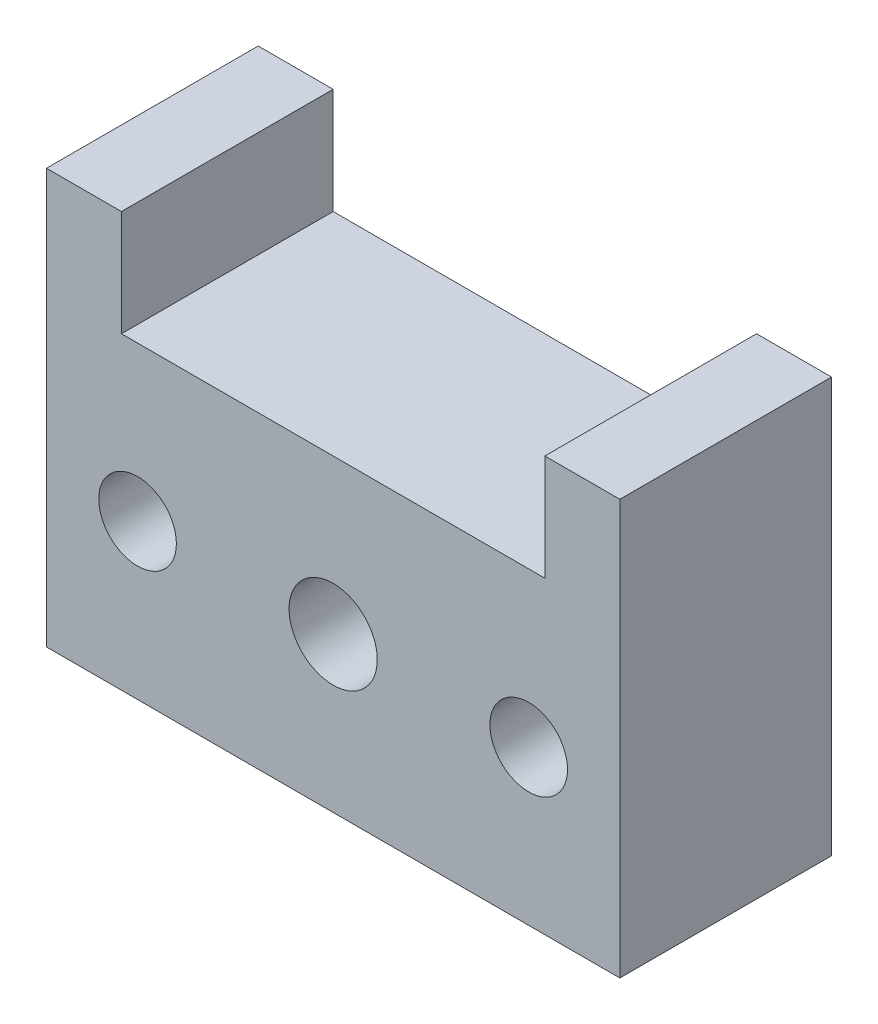
ISO-10303-21;
HEADER;
FILE_DESCRIPTION(('STEP AP214'),'2;1');
FILE_NAME('part.step','',(''),(''),'','','');
FILE_SCHEMA(('AUTOMOTIVE_DESIGN { 1 0 10303 214 1 1 1 1 }'));
ENDSEC;
DATA;
#1=APPLICATION_CONTEXT('core data for automotive mechanical design processes');
#2=APPLICATION_PROTOCOL_DEFINITION('international standard','automotive_design',2000,#1);
#3=PRODUCT_CONTEXT('',#1,'mechanical');
#4=PRODUCT('Part','Part','',(#3));
#5=PRODUCT_RELATED_PRODUCT_CATEGORY('part','',(#4));
#6=PRODUCT_DEFINITION_FORMATION('','',#4);
#7=PRODUCT_DEFINITION_CONTEXT('part definition',#1,'design');
#8=PRODUCT_DEFINITION('design','',#6,#7);
#9=PRODUCT_DEFINITION_SHAPE('','',#8);
#10=(LENGTH_UNIT() NAMED_UNIT(*) SI_UNIT(.MILLI.,.METRE.));
#11=(NAMED_UNIT(*) PLANE_ANGLE_UNIT() SI_UNIT($,.RADIAN.));
#12=(NAMED_UNIT(*) SI_UNIT($,.STERADIAN.) SOLID_ANGLE_UNIT());
#13=UNCERTAINTY_MEASURE_WITH_UNIT(LENGTH_MEASURE(1.E-05),#10,'distance_accuracy_value','');
#14=(GEOMETRIC_REPRESENTATION_CONTEXT(3) GLOBAL_UNCERTAINTY_ASSIGNED_CONTEXT((#13)) GLOBAL_UNIT_ASSIGNED_CONTEXT((#10,
#11,#12)) REPRESENTATION_CONTEXT('',''));
#15=CARTESIAN_POINT('',(0.,0.,0.));
#16=DIRECTION('',(0.,0.,1.));
#17=DIRECTION('',(1.,0.,0.));
#18=AXIS2_PLACEMENT_3D('',#15,#16,#17);
#19=CARTESIAN_POINT('',(22.1712802086963,0.,24.));
#20=DIRECTION('',(0.,0.,-1.));
#21=DIRECTION('',(-1.,0.,0.));
#22=AXIS2_PLACEMENT_3D('',#19,#20,#21);
#23=CYLINDRICAL_SURFACE('',#22,4.4);
#24=CARTESIAN_POINT('',(22.1712802086963,0.,24.));
#25=DIRECTION('',(0.,0.,1.));
#26=DIRECTION('',(1.,0.,0.));
#27=AXIS2_PLACEMENT_3D('',#24,#25,#26);
#28=CIRCLE('',#27,4.4);
#29=CARTESIAN_POINT('',(26.5712802086963,0.,24.));
#30=VERTEX_POINT('',#29);
#31=EDGE_CURVE('E145',#30,#30,#28,.F.);
#32=ORIENTED_EDGE('',*,*,#31,.F.);
#33=EDGE_LOOP('',(#32));
#34=FACE_BOUND('',#33,.T.);
#35=CARTESIAN_POINT('',(22.1712802086963,0.,0.));
#36=DIRECTION('',(0.,0.,1.));
#37=DIRECTION('',(1.,0.,0.));
#38=AXIS2_PLACEMENT_3D('',#35,#36,#37);
#39=CIRCLE('',#38,4.4);
#40=CARTESIAN_POINT('',(26.5712802086963,0.,0.));
#41=VERTEX_POINT('',#40);
#42=EDGE_CURVE('E146',#41,#41,#39,.F.);
#43=ORIENTED_EDGE('',*,*,#42,.T.);
#44=EDGE_LOOP('',(#43));
#45=FACE_BOUND('',#44,.T.);
#46=ADVANCED_FACE('F41',(#34,#45),#23,.F.);
#47=CARTESIAN_POINT('',(-22.1712802086963,0.,24.));
#48=DIRECTION('',(0.,0.,-1.));
#49=DIRECTION('',(-1.,0.,0.));
#50=AXIS2_PLACEMENT_3D('',#47,#48,#49);
#51=CYLINDRICAL_SURFACE('',#50,4.4);
#52=CARTESIAN_POINT('',(-22.1712802086963,0.,24.));
#53=DIRECTION('',(0.,0.,1.));
#54=DIRECTION('',(1.,0.,0.));
#55=AXIS2_PLACEMENT_3D('',#52,#53,#54);
#56=CIRCLE('',#55,4.4);
#57=CARTESIAN_POINT('',(-17.7712802086963,0.,24.));
#58=VERTEX_POINT('',#57);
#59=EDGE_CURVE('E164',#58,#58,#56,.T.);
#60=ORIENTED_EDGE('',*,*,#59,.T.);
#61=EDGE_LOOP('',(#60));
#62=FACE_BOUND('',#61,.T.);
#63=CARTESIAN_POINT('',(-22.1712802086963,0.,0.));
#64=DIRECTION('',(0.,0.,1.));
#65=DIRECTION('',(1.,0.,0.));
#66=AXIS2_PLACEMENT_3D('',#63,#64,#65);
#67=CIRCLE('',#66,4.4);
#68=CARTESIAN_POINT('',(-17.7712802086963,0.,0.));
#69=VERTEX_POINT('',#68);
#70=EDGE_CURVE('E150',#69,#69,#67,.T.);
#71=ORIENTED_EDGE('',*,*,#70,.F.);
#72=EDGE_LOOP('',(#71));
#73=FACE_BOUND('',#72,.T.);
#74=ADVANCED_FACE('F217',(#62,#73),#51,.F.);
#75=CARTESIAN_POINT('',(0.,0.,24.));
#76=DIRECTION('',(0.,0.,-1.));
#77=DIRECTION('',(-1.,0.,0.));
#78=AXIS2_PLACEMENT_3D('',#75,#76,#77);
#79=CYLINDRICAL_SURFACE('',#78,5.);
#80=CARTESIAN_POINT('',(0.,0.,24.));
#81=DIRECTION('',(0.,0.,1.));
#82=DIRECTION('',(1.,0.,0.));
#83=AXIS2_PLACEMENT_3D('',#80,#81,#82);
#84=CIRCLE('',#83,5.);
#85=CARTESIAN_POINT('',(5.,0.,24.));
#86=VERTEX_POINT('',#85);
#87=EDGE_CURVE('E167',#86,#86,#84,.T.);
#88=ORIENTED_EDGE('',*,*,#87,.T.);
#89=EDGE_LOOP('',(#88));
#90=FACE_BOUND('',#89,.T.);
#91=CARTESIAN_POINT('',(0.,0.,0.));
#92=DIRECTION('',(0.,0.,1.));
#93=DIRECTION('',(1.,0.,0.));
#94=AXIS2_PLACEMENT_3D('',#91,#92,#93);
#95=CIRCLE('',#94,5.);
#96=CARTESIAN_POINT('',(5.,0.,0.));
#97=VERTEX_POINT('',#96);
#98=EDGE_CURVE('E153',#97,#97,#95,.T.);
#99=ORIENTED_EDGE('',*,*,#98,.F.);
#100=EDGE_LOOP('',(#99));
#101=FACE_BOUND('',#100,.T.);
#102=ADVANCED_FACE('F210',(#90,#101),#79,.F.);
#103=CARTESIAN_POINT('',(-32.5000000000004,0.,24.));
#104=DIRECTION('',(1.,0.,0.));
#105=DIRECTION('',(0.,1.,0.));
#106=AXIS2_PLACEMENT_3D('',#103,#104,#105);
#107=PLANE('',#106);
#108=DIRECTION('',(0.,-1.,0.));
#109=VECTOR('',#108,1.);
#110=CARTESIAN_POINT('',(-32.5000000000004,0.,0.));
#111=LINE('',#110,#109);
#112=CARTESIAN_POINT('',(-32.5000000000004,29.5,0.));
#113=VERTEX_POINT('',#112);
#114=CARTESIAN_POINT('',(-32.5000000000004,-17.5,0.));
#115=VERTEX_POINT('',#114);
#116=EDGE_CURVE('E158',#113,#115,#111,.T.);
#117=ORIENTED_EDGE('',*,*,#116,.T.);
#118=DIRECTION('',(0.,0.,-1.));
#119=VECTOR('',#118,1.);
#120=CARTESIAN_POINT('',(-32.5000000000004,-17.5,24.));
#121=LINE('',#120,#119);
#122=CARTESIAN_POINT('',(-32.5000000000004,-17.5,24.));
#123=VERTEX_POINT('',#122);
#124=EDGE_CURVE('E141',#123,#115,#121,.T.);
#125=ORIENTED_EDGE('',*,*,#124,.F.);
#126=DIRECTION('',(0.,-1.,0.));
#127=VECTOR('',#126,1.);
#128=CARTESIAN_POINT('',(-32.5000000000004,0.,24.));
#129=LINE('',#128,#127);
#130=CARTESIAN_POINT('',(-32.5000000000004,29.5,24.));
#131=VERTEX_POINT('',#130);
#132=EDGE_CURVE('E173',#131,#123,#129,.T.);
#133=ORIENTED_EDGE('',*,*,#132,.F.);
#134=DIRECTION('',(0.,0.,-1.));
#135=VECTOR('',#134,1.);
#136=CARTESIAN_POINT('',(-32.5000000000004,29.5,24.));
#137=LINE('',#136,#135);
#138=EDGE_CURVE('E107',#131,#113,#137,.T.);
#139=ORIENTED_EDGE('',*,*,#138,.T.);
#140=EDGE_LOOP('',(#117,#125,#133,#139));
#141=FACE_BOUND('',#140,.T.);
#142=ADVANCED_FACE('F208',(#141),#107,.F.);
#143=CARTESIAN_POINT('',(0.,-17.5,24.));
#144=DIRECTION('',(0.,1.,0.));
#145=DIRECTION('',(0.,0.,1.));
#146=AXIS2_PLACEMENT_3D('',#143,#144,#145);
#147=PLANE('',#146);
#148=DIRECTION('',(1.,0.,0.));
#149=VECTOR('',#148,1.);
#150=CARTESIAN_POINT('',(0.,-17.5,0.));
#151=LINE('',#150,#149);
#152=CARTESIAN_POINT('',(32.4999999999996,-17.5,0.));
#153=VERTEX_POINT('',#152);
#154=EDGE_CURVE('E156',#115,#153,#151,.T.);
#155=ORIENTED_EDGE('',*,*,#154,.T.);
#156=DIRECTION('',(0.,0.,-1.));
#157=VECTOR('',#156,1.);
#158=CARTESIAN_POINT('',(32.4999999999996,-17.5,24.));
#159=LINE('',#158,#157);
#160=CARTESIAN_POINT('',(32.4999999999996,-17.5,24.));
#161=VERTEX_POINT('',#160);
#162=EDGE_CURVE('E101',#161,#153,#159,.T.);
#163=ORIENTED_EDGE('',*,*,#162,.F.);
#164=DIRECTION('',(1.,0.,0.));
#165=VECTOR('',#164,1.);
#166=CARTESIAN_POINT('',(0.,-17.5,24.));
#167=LINE('',#166,#165);
#168=EDGE_CURVE('E170',#123,#161,#167,.T.);
#169=ORIENTED_EDGE('',*,*,#168,.F.);
#170=ORIENTED_EDGE('',*,*,#124,.T.);
#171=EDGE_LOOP('',(#155,#163,#169,#170));
#172=FACE_BOUND('',#171,.T.);
#173=ADVANCED_FACE('F189',(#172),#147,.F.);
#174=CARTESIAN_POINT('',(0.,0.,0.));
#175=DIRECTION('',(0.,0.,1.));
#176=DIRECTION('',(1.,0.,0.));
#177=AXIS2_PLACEMENT_3D('',#174,#175,#176);
#178=PLANE('',#177);
#179=DIRECTION('',(0.,-1.,0.));
#180=VECTOR('',#179,1.);
#181=CARTESIAN_POINT('',(32.4999999999996,0.,0.));
#182=LINE('',#181,#180);
#183=CARTESIAN_POINT('',(32.5000000000004,29.5,0.));
#184=VERTEX_POINT('',#183);
#185=EDGE_CURVE('E93',#184,#153,#182,.T.);
#186=ORIENTED_EDGE('',*,*,#185,.T.);
#187=ORIENTED_EDGE('',*,*,#154,.F.);
#188=ORIENTED_EDGE('',*,*,#116,.F.);
#189=DIRECTION('',(1.,0.,0.));
#190=VECTOR('',#189,1.);
#191=CARTESIAN_POINT('',(-32.5000000000004,29.5,0.));
#192=LINE('',#191,#190);
#193=CARTESIAN_POINT('',(-24.,29.5,0.));
#194=VERTEX_POINT('',#193);
#195=EDGE_CURVE('E114',#113,#194,#192,.T.);
#196=ORIENTED_EDGE('',*,*,#195,.T.);
#197=DIRECTION('',(0.,1.,0.));
#198=VECTOR('',#197,1.);
#199=CARTESIAN_POINT('',(-24.0000000000004,17.5,0.));
#200=LINE('',#199,#198);
#201=CARTESIAN_POINT('',(-24.0000000000004,17.5,0.));
#202=VERTEX_POINT('',#201);
#203=EDGE_CURVE('E132',#202,#194,#200,.T.);
#204=ORIENTED_EDGE('',*,*,#203,.F.);
#205=DIRECTION('',(1.,0.,0.));
#206=VECTOR('',#205,1.);
#207=CARTESIAN_POINT('',(0.,17.5,0.));
#208=LINE('',#207,#206);
#209=CARTESIAN_POINT('',(24.0000000000004,17.5,0.));
#210=VERTEX_POINT('',#209);
#211=EDGE_CURVE('E106',#202,#210,#208,.T.);
#212=ORIENTED_EDGE('',*,*,#211,.T.);
#213=DIRECTION('',(0.,1.,0.));
#214=VECTOR('',#213,1.);
#215=CARTESIAN_POINT('',(24.0000000000004,17.5,0.));
#216=LINE('',#215,#214);
#217=CARTESIAN_POINT('',(24.,29.5,0.));
#218=VERTEX_POINT('',#217);
#219=EDGE_CURVE('E119',#210,#218,#216,.T.);
#220=ORIENTED_EDGE('',*,*,#219,.T.);
#221=DIRECTION('',(-1.,0.,0.));
#222=VECTOR('',#221,1.);
#223=CARTESIAN_POINT('',(32.5000000000004,29.5,0.));
#224=LINE('',#223,#222);
#225=EDGE_CURVE('E111',#184,#218,#224,.T.);
#226=ORIENTED_EDGE('',*,*,#225,.F.);
#227=EDGE_LOOP('',(#186,#187,#188,#196,#204,#212,#220,#226));
#228=FACE_BOUND('',#227,.T.);
#229=ORIENTED_EDGE('',*,*,#98,.T.);
#230=EDGE_LOOP('',(#229));
#231=FACE_BOUND('',#230,.T.);
#232=ORIENTED_EDGE('',*,*,#70,.T.);
#233=EDGE_LOOP('',(#232));
#234=FACE_BOUND('',#233,.T.);
#235=ORIENTED_EDGE('',*,*,#42,.F.);
#236=EDGE_LOOP('',(#235));
#237=FACE_BOUND('',#236,.T.);
#238=ADVANCED_FACE('F116',(#228,#231,#234,#237),#178,.F.);
#239=CARTESIAN_POINT('',(0.,0.,24.));
#240=DIRECTION('',(0.,0.,1.));
#241=DIRECTION('',(1.,0.,0.));
#242=AXIS2_PLACEMENT_3D('',#239,#240,#241);
#243=PLANE('',#242);
#244=DIRECTION('',(0.,-1.,0.));
#245=VECTOR('',#244,1.);
#246=CARTESIAN_POINT('',(32.4999999999996,0.,24.));
#247=LINE('',#246,#245);
#248=CARTESIAN_POINT('',(32.5000000000004,29.5,24.));
#249=VERTEX_POINT('',#248);
#250=EDGE_CURVE('E149',#249,#161,#247,.T.);
#251=ORIENTED_EDGE('',*,*,#250,.F.);
#252=DIRECTION('',(-1.,0.,0.));
#253=VECTOR('',#252,1.);
#254=CARTESIAN_POINT('',(32.5000000000004,29.5,24.));
#255=LINE('',#254,#253);
#256=CARTESIAN_POINT('',(24.,29.5,24.));
#257=VERTEX_POINT('',#256);
#258=EDGE_CURVE('E113',#249,#257,#255,.T.);
#259=ORIENTED_EDGE('',*,*,#258,.T.);
#260=DIRECTION('',(0.,1.,0.));
#261=VECTOR('',#260,1.);
#262=CARTESIAN_POINT('',(24.0000000000004,17.5,24.));
#263=LINE('',#262,#261);
#264=CARTESIAN_POINT('',(24.0000000000004,17.5,24.));
#265=VERTEX_POINT('',#264);
#266=EDGE_CURVE('E120',#265,#257,#263,.T.);
#267=ORIENTED_EDGE('',*,*,#266,.F.);
#268=DIRECTION('',(1.,0.,0.));
#269=VECTOR('',#268,1.);
#270=CARTESIAN_POINT('',(0.,17.5,24.));
#271=LINE('',#270,#269);
#272=CARTESIAN_POINT('',(-24.0000000000004,17.5,24.));
#273=VERTEX_POINT('',#272);
#274=EDGE_CURVE('E176',#273,#265,#271,.T.);
#275=ORIENTED_EDGE('',*,*,#274,.F.);
#276=DIRECTION('',(0.,1.,0.));
#277=VECTOR('',#276,1.);
#278=CARTESIAN_POINT('',(-24.0000000000004,17.5,24.));
#279=LINE('',#278,#277);
#280=CARTESIAN_POINT('',(-24.,29.5,24.));
#281=VERTEX_POINT('',#280);
#282=EDGE_CURVE('E128',#273,#281,#279,.T.);
#283=ORIENTED_EDGE('',*,*,#282,.T.);
#284=DIRECTION('',(1.,0.,0.));
#285=VECTOR('',#284,1.);
#286=CARTESIAN_POINT('',(-32.5000000000004,29.5,24.));
#287=LINE('',#286,#285);
#288=EDGE_CURVE('E135',#131,#281,#287,.T.);
#289=ORIENTED_EDGE('',*,*,#288,.F.);
#290=ORIENTED_EDGE('',*,*,#132,.T.);
#291=ORIENTED_EDGE('',*,*,#168,.T.);
#292=EDGE_LOOP('',(#251,#259,#267,#275,#283,#289,#290,#291));
#293=FACE_BOUND('',#292,.T.);
#294=ORIENTED_EDGE('',*,*,#87,.F.);
#295=EDGE_LOOP('',(#294));
#296=FACE_BOUND('',#295,.T.);
#297=ORIENTED_EDGE('',*,*,#59,.F.);
#298=EDGE_LOOP('',(#297));
#299=FACE_BOUND('',#298,.T.);
#300=ORIENTED_EDGE('',*,*,#31,.T.);
#301=EDGE_LOOP('',(#300));
#302=FACE_BOUND('',#301,.T.);
#303=ADVANCED_FACE('F183',(#293,#296,#299,#302),#243,.T.);
#304=CARTESIAN_POINT('',(0.,17.5,24.));
#305=DIRECTION('',(0.,1.,0.));
#306=DIRECTION('',(0.,0.,1.));
#307=AXIS2_PLACEMENT_3D('',#304,#305,#306);
#308=PLANE('',#307);
#309=DIRECTION('',(0.,0.,-1.));
#310=VECTOR('',#309,1.);
#311=CARTESIAN_POINT('',(-24.0000000000004,17.5,24.));
#312=LINE('',#311,#310);
#313=EDGE_CURVE('E11',#273,#202,#312,.T.);
#314=ORIENTED_EDGE('',*,*,#313,.F.);
#315=ORIENTED_EDGE('',*,*,#274,.T.);
#316=DIRECTION('',(0.,0.,-1.));
#317=VECTOR('',#316,1.);
#318=CARTESIAN_POINT('',(24.0000000000004,17.5,24.));
#319=LINE('',#318,#317);
#320=EDGE_CURVE('E45',#265,#210,#319,.T.);
#321=ORIENTED_EDGE('',*,*,#320,.T.);
#322=ORIENTED_EDGE('',*,*,#211,.F.);
#323=EDGE_LOOP('',(#314,#315,#321,#322));
#324=FACE_BOUND('',#323,.T.);
#325=ADVANCED_FACE('F197',(#324),#308,.T.);
#326=CARTESIAN_POINT('',(32.4999999999996,0.,24.));
#327=DIRECTION('',(1.,0.,0.));
#328=DIRECTION('',(0.,0.,-1.));
#329=AXIS2_PLACEMENT_3D('',#326,#327,#328);
#330=PLANE('',#329);
#331=ORIENTED_EDGE('',*,*,#185,.F.);
#332=DIRECTION('',(0.,0.,-1.));
#333=VECTOR('',#332,1.);
#334=CARTESIAN_POINT('',(32.5000000000004,29.5,24.));
#335=LINE('',#334,#333);
#336=EDGE_CURVE('E97',#249,#184,#335,.T.);
#337=ORIENTED_EDGE('',*,*,#336,.F.);
#338=ORIENTED_EDGE('',*,*,#250,.T.);
#339=ORIENTED_EDGE('',*,*,#162,.T.);
#340=EDGE_LOOP('',(#331,#337,#338,#339));
#341=FACE_BOUND('',#340,.T.);
#342=ADVANCED_FACE('F95',(#341),#330,.T.);
#343=CARTESIAN_POINT('',(32.5000000000004,29.5,24.));
#344=DIRECTION('',(0.,-1.,0.));
#345=DIRECTION('',(0.,0.,-1.));
#346=AXIS2_PLACEMENT_3D('',#343,#344,#345);
#347=PLANE('',#346);
#348=ORIENTED_EDGE('',*,*,#225,.T.);
#349=DIRECTION('',(0.,0.,-1.));
#350=VECTOR('',#349,1.);
#351=CARTESIAN_POINT('',(24.,29.5,24.));
#352=LINE('',#351,#350);
#353=EDGE_CURVE('E86',#257,#218,#352,.T.);
#354=ORIENTED_EDGE('',*,*,#353,.F.);
#355=ORIENTED_EDGE('',*,*,#258,.F.);
#356=ORIENTED_EDGE('',*,*,#336,.T.);
#357=EDGE_LOOP('',(#348,#354,#355,#356));
#358=FACE_BOUND('',#357,.T.);
#359=ADVANCED_FACE('F110',(#358),#347,.F.);
#360=CARTESIAN_POINT('',(24.0000000000004,17.5,24.));
#361=DIRECTION('',(-1.,0.,0.));
#362=DIRECTION('',(0.,-1.,0.));
#363=AXIS2_PLACEMENT_3D('',#360,#361,#362);
#364=PLANE('',#363);
#365=ORIENTED_EDGE('',*,*,#219,.F.);
#366=ORIENTED_EDGE('',*,*,#320,.F.);
#367=ORIENTED_EDGE('',*,*,#266,.T.);
#368=ORIENTED_EDGE('',*,*,#353,.T.);
#369=EDGE_LOOP('',(#365,#366,#367,#368));
#370=FACE_BOUND('',#369,.T.);
#371=ADVANCED_FACE('F43',(#370),#364,.T.);
#372=CARTESIAN_POINT('',(-32.5000000000004,29.5,24.));
#373=DIRECTION('',(0.,1.,0.));
#374=DIRECTION('',(0.,0.,1.));
#375=AXIS2_PLACEMENT_3D('',#372,#373,#374);
#376=PLANE('',#375);
#377=ORIENTED_EDGE('',*,*,#195,.F.);
#378=ORIENTED_EDGE('',*,*,#138,.F.);
#379=ORIENTED_EDGE('',*,*,#288,.T.);
#380=DIRECTION('',(0.,0.,-1.));
#381=VECTOR('',#380,1.);
#382=CARTESIAN_POINT('',(-24.,29.5,24.));
#383=LINE('',#382,#381);
#384=EDGE_CURVE('E127',#281,#194,#383,.T.);
#385=ORIENTED_EDGE('',*,*,#384,.T.);
#386=EDGE_LOOP('',(#377,#378,#379,#385));
#387=FACE_BOUND('',#386,.T.);
#388=ADVANCED_FACE('F207',(#387),#376,.T.);
#389=CARTESIAN_POINT('',(-24.0000000000004,17.5,24.));
#390=DIRECTION('',(-1.,0.,0.));
#391=DIRECTION('',(0.,-1.,0.));
#392=AXIS2_PLACEMENT_3D('',#389,#390,#391);
#393=PLANE('',#392);
#394=ORIENTED_EDGE('',*,*,#203,.T.);
#395=ORIENTED_EDGE('',*,*,#384,.F.);
#396=ORIENTED_EDGE('',*,*,#282,.F.);
#397=ORIENTED_EDGE('',*,*,#313,.T.);
#398=EDGE_LOOP('',(#394,#395,#396,#397));
#399=FACE_BOUND('',#398,.T.);
#400=ADVANCED_FACE('F203',(#399),#393,.F.);
#401=CLOSED_SHELL('',(#46,#74,#102,#142,#173,#238,#303,#325,#342,#359,#371,#388,#400));
#402=MANIFOLD_SOLID_BREP('B2',#401);
#403=ADVANCED_BREP_SHAPE_REPRESENTATION('',(#18,#402),#14);
#404=SHAPE_DEFINITION_REPRESENTATION(#9,#403);
ENDSEC;
END-ISO-10303-21;
